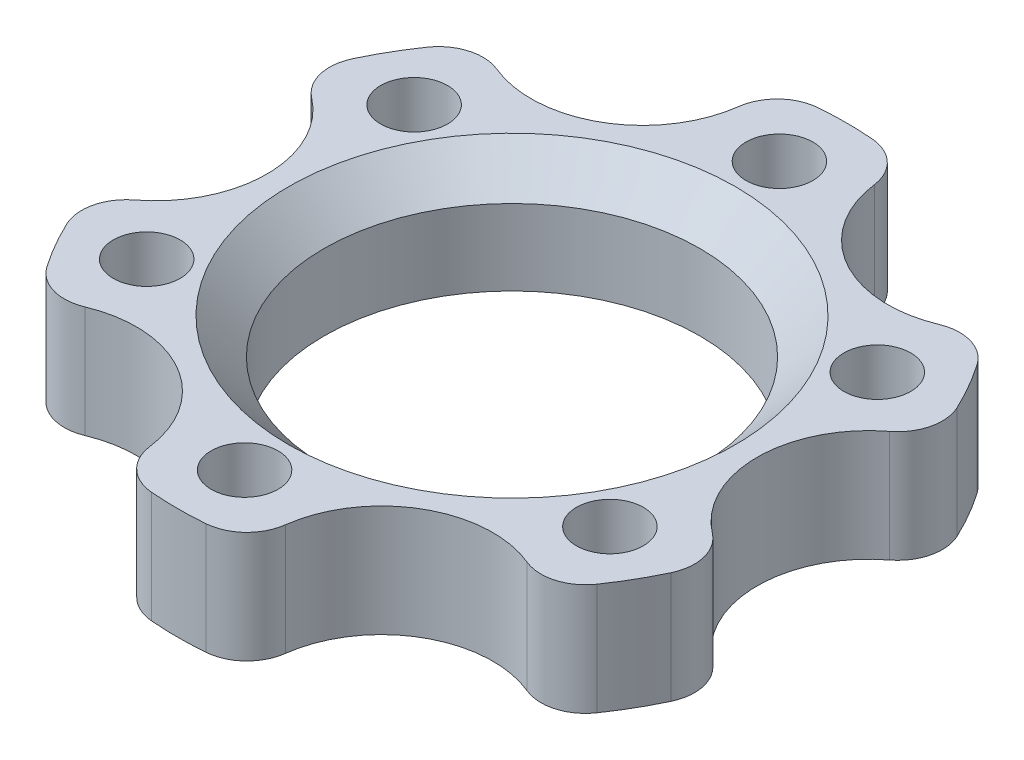
ISO-10303-21;
HEADER;
FILE_DESCRIPTION(('STEP AP214'),'2;1');
FILE_NAME('part.step','',(''),(''),'','','');
FILE_SCHEMA(('AUTOMOTIVE_DESIGN { 1 0 10303 214 1 1 1 1 }'));
ENDSEC;
DATA;
#1=APPLICATION_CONTEXT('core data for automotive mechanical design processes');
#2=APPLICATION_PROTOCOL_DEFINITION('international standard','automotive_design',2000,#1);
#3=PRODUCT_CONTEXT('',#1,'mechanical');
#4=PRODUCT('Part','Part','',(#3));
#5=PRODUCT_RELATED_PRODUCT_CATEGORY('part','',(#4));
#6=PRODUCT_DEFINITION_FORMATION('','',#4);
#7=PRODUCT_DEFINITION_CONTEXT('part definition',#1,'design');
#8=PRODUCT_DEFINITION('design','',#6,#7);
#9=PRODUCT_DEFINITION_SHAPE('','',#8);
#10=(LENGTH_UNIT() NAMED_UNIT(*) SI_UNIT(.MILLI.,.METRE.));
#11=(NAMED_UNIT(*) PLANE_ANGLE_UNIT() SI_UNIT($,.RADIAN.));
#12=(NAMED_UNIT(*) SI_UNIT($,.STERADIAN.) SOLID_ANGLE_UNIT());
#13=UNCERTAINTY_MEASURE_WITH_UNIT(LENGTH_MEASURE(1.E-05),#10,'distance_accuracy_value','');
#14=(GEOMETRIC_REPRESENTATION_CONTEXT(3) GLOBAL_UNCERTAINTY_ASSIGNED_CONTEXT((#13)) GLOBAL_UNIT_ASSIGNED_CONTEXT((#10,
#11,#12)) REPRESENTATION_CONTEXT('',''));
#15=CARTESIAN_POINT('',(0.,0.,0.));
#16=DIRECTION('',(0.,0.,1.));
#17=DIRECTION('',(1.,0.,0.));
#18=AXIS2_PLACEMENT_3D('',#15,#16,#17);
#19=CARTESIAN_POINT('',(0.,0.,0.));
#20=DIRECTION('',(0.,-1.,0.));
#21=DIRECTION('',(0.,0.,-1.));
#22=AXIS2_PLACEMENT_3D('',#19,#20,#21);
#23=CYLINDRICAL_SURFACE('',#22,47.625);
#24=CARTESIAN_POINT('',(0.,-9.525,0.));
#25=DIRECTION('',(0.,-1.,0.));
#26=DIRECTION('',(0.,0.,-1.));
#27=AXIS2_PLACEMENT_3D('',#24,#25,#26);
#28=CIRCLE('',#27,47.625);
#29=CARTESIAN_POINT('',(-39.1695923526614,-9.525,27.0902871879634));
#30=VERTEX_POINT('',#29);
#31=CARTESIAN_POINT('',(-43.0456730769231,-9.525,20.3767184393037));
#32=VERTEX_POINT('',#31);
#33=EDGE_CURVE('E282',#30,#32,#28,.T.);
#34=ORIENTED_EDGE('',*,*,#33,.F.);
#35=DIRECTION('',(0.,-1.,0.));
#36=VECTOR('',#35,1.);
#37=CARTESIAN_POINT('',(-39.1695923526614,0.,27.0902871879634));
#38=LINE('',#37,#36);
#39=CARTESIAN_POINT('',(-39.1695923526614,6.35,27.0902871879634));
#40=VERTEX_POINT('',#39);
#41=EDGE_CURVE('E310',#30,#40,#38,.F.);
#42=ORIENTED_EDGE('',*,*,#41,.T.);
#43=CARTESIAN_POINT('',(0.,6.35,0.));
#44=DIRECTION('',(0.,-1.,0.));
#45=DIRECTION('',(0.,0.,-1.));
#46=AXIS2_PLACEMENT_3D('',#43,#44,#45);
#47=CIRCLE('',#46,47.625);
#48=CARTESIAN_POINT('',(-43.0456730769231,6.35,20.3767184393037));
#49=VERTEX_POINT('',#48);
#50=EDGE_CURVE('E238',#40,#49,#47,.T.);
#51=ORIENTED_EDGE('',*,*,#50,.T.);
#52=DIRECTION('',(0.,-1.,0.));
#53=VECTOR('',#52,1.);
#54=CARTESIAN_POINT('',(-43.0456730769231,0.,20.3767184393037));
#55=LINE('',#54,#53);
#56=EDGE_CURVE('E313',#49,#32,#55,.T.);
#57=ORIENTED_EDGE('',*,*,#56,.T.);
#58=EDGE_LOOP('',(#34,#42,#51,#57));
#59=FACE_BOUND('',#58,.T.);
#60=ADVANCED_FACE('F44',(#59),#23,.T.);
#61=CARTESIAN_POINT('',(-43.0456730769231,6.35,-20.3767184393037));
#62=VERTEX_POINT('',#61);
#63=CARTESIAN_POINT('',(-39.1695923526613,6.35,-27.0902871879634));
#64=VERTEX_POINT('',#63);
#65=EDGE_CURVE('E240',#62,#64,#47,.T.);
#66=ORIENTED_EDGE('',*,*,#65,.T.);
#67=DIRECTION('',(0.,-1.,0.));
#68=VECTOR('',#67,1.);
#69=CARTESIAN_POINT('',(-39.1695923526613,0.,-27.0902871879634));
#70=LINE('',#69,#68);
#71=CARTESIAN_POINT('',(-39.1695923526613,-9.525,-27.0902871879634));
#72=VERTEX_POINT('',#71);
#73=EDGE_CURVE('E370',#64,#72,#70,.T.);
#74=ORIENTED_EDGE('',*,*,#73,.T.);
#75=CARTESIAN_POINT('',(-43.0456730769231,-9.525,-20.3767184393037));
#76=VERTEX_POINT('',#75);
#77=EDGE_CURVE('E276',#76,#72,#28,.T.);
#78=ORIENTED_EDGE('',*,*,#77,.F.);
#79=DIRECTION('',(0.,-1.,0.));
#80=VECTOR('',#79,1.);
#81=CARTESIAN_POINT('',(-43.0456730769231,0.,-20.3767184393037));
#82=LINE('',#81,#80);
#83=EDGE_CURVE('E367',#76,#62,#82,.F.);
#84=ORIENTED_EDGE('',*,*,#83,.T.);
#85=EDGE_LOOP('',(#66,#74,#78,#84));
#86=FACE_BOUND('',#85,.T.);
#87=ADVANCED_FACE('F494',(#86),#23,.T.);
#88=CARTESIAN_POINT('',(3.87608072426172,6.35,47.4670056272671));
#89=VERTEX_POINT('',#88);
#90=CARTESIAN_POINT('',(-3.87608072426172,6.35,47.4670056272671));
#91=VERTEX_POINT('',#90);
#92=EDGE_CURVE('E223',#89,#91,#47,.T.);
#93=ORIENTED_EDGE('',*,*,#92,.T.);
#94=DIRECTION('',(0.,-1.,0.));
#95=VECTOR('',#94,1.);
#96=CARTESIAN_POINT('',(-3.87608072426172,0.,47.4670056272671));
#97=LINE('',#96,#95);
#98=CARTESIAN_POINT('',(-3.87608072426172,-9.525,47.4670056272671));
#99=VERTEX_POINT('',#98);
#100=EDGE_CURVE('E228',#91,#99,#97,.T.);
#101=ORIENTED_EDGE('',*,*,#100,.T.);
#102=CARTESIAN_POINT('',(3.87608072426172,-9.525,47.4670056272671));
#103=VERTEX_POINT('',#102);
#104=EDGE_CURVE('E226',#103,#99,#28,.T.);
#105=ORIENTED_EDGE('',*,*,#104,.F.);
#106=DIRECTION('',(0.,-1.,0.));
#107=VECTOR('',#106,1.);
#108=CARTESIAN_POINT('',(3.87608072426172,0.,47.4670056272671));
#109=LINE('',#108,#107);
#110=EDGE_CURVE('E209',#103,#89,#109,.F.);
#111=ORIENTED_EDGE('',*,*,#110,.T.);
#112=EDGE_LOOP('',(#93,#101,#105,#111));
#113=FACE_BOUND('',#112,.T.);
#114=ADVANCED_FACE('F221',(#113),#23,.T.);
#115=CARTESIAN_POINT('',(43.0456730769231,6.35,20.3767184393037));
#116=VERTEX_POINT('',#115);
#117=CARTESIAN_POINT('',(39.1695923526613,6.35,27.0902871879634));
#118=VERTEX_POINT('',#117);
#119=EDGE_CURVE('E237',#116,#118,#47,.T.);
#120=ORIENTED_EDGE('',*,*,#119,.T.);
#121=DIRECTION('',(0.,-1.,0.));
#122=VECTOR('',#121,1.);
#123=CARTESIAN_POINT('',(39.1695923526613,0.,27.0902871879634));
#124=LINE('',#123,#122);
#125=CARTESIAN_POINT('',(39.1695923526613,-9.525,27.0902871879634));
#126=VERTEX_POINT('',#125);
#127=EDGE_CURVE('E324',#118,#126,#124,.T.);
#128=ORIENTED_EDGE('',*,*,#127,.T.);
#129=CARTESIAN_POINT('',(43.0456730769231,-9.525,20.3767184393037));
#130=VERTEX_POINT('',#129);
#131=EDGE_CURVE('E283',#130,#126,#28,.T.);
#132=ORIENTED_EDGE('',*,*,#131,.F.);
#133=DIRECTION('',(0.,-1.,0.));
#134=VECTOR('',#133,1.);
#135=CARTESIAN_POINT('',(43.0456730769231,0.,20.3767184393037));
#136=LINE('',#135,#134);
#137=EDGE_CURVE('E319',#130,#116,#136,.F.);
#138=ORIENTED_EDGE('',*,*,#137,.T.);
#139=EDGE_LOOP('',(#120,#128,#132,#138));
#140=FACE_BOUND('',#139,.T.);
#141=ADVANCED_FACE('F513',(#140),#23,.T.);
#142=CARTESIAN_POINT('',(39.1695923526614,6.35,-27.0902871879634));
#143=VERTEX_POINT('',#142);
#144=CARTESIAN_POINT('',(43.0456730769231,6.35,-20.3767184393037));
#145=VERTEX_POINT('',#144);
#146=EDGE_CURVE('E244',#143,#145,#47,.T.);
#147=ORIENTED_EDGE('',*,*,#146,.T.);
#148=DIRECTION('',(0.,-1.,0.));
#149=VECTOR('',#148,1.);
#150=CARTESIAN_POINT('',(43.0456730769231,0.,-20.3767184393037));
#151=LINE('',#150,#149);
#152=CARTESIAN_POINT('',(43.0456730769231,-9.525,-20.3767184393037));
#153=VERTEX_POINT('',#152);
#154=EDGE_CURVE('E346',#145,#153,#151,.T.);
#155=ORIENTED_EDGE('',*,*,#154,.T.);
#156=CARTESIAN_POINT('',(39.1695923526614,-9.525,-27.0902871879634));
#157=VERTEX_POINT('',#156);
#158=EDGE_CURVE('E277',#157,#153,#28,.T.);
#159=ORIENTED_EDGE('',*,*,#158,.F.);
#160=DIRECTION('',(0.,-1.,0.));
#161=VECTOR('',#160,1.);
#162=CARTESIAN_POINT('',(39.1695923526614,0.,-27.0902871879634));
#163=LINE('',#162,#161);
#164=EDGE_CURVE('E343',#157,#143,#163,.F.);
#165=ORIENTED_EDGE('',*,*,#164,.T.);
#166=EDGE_LOOP('',(#147,#155,#159,#165));
#167=FACE_BOUND('',#166,.T.);
#168=ADVANCED_FACE('F503',(#167),#23,.T.);
#169=CARTESIAN_POINT('',(0.,1.26999999999998,0.));
#170=DIRECTION('',(0.,1.,0.));
#171=DIRECTION('',(0.,0.,1.));
#172=AXIS2_PLACEMENT_3D('',#169,#170,#171);
#173=CONICAL_SURFACE('',#172,26.7598025612107,0.785398163397454);
#174=CARTESIAN_POINT('',(0.,6.35,0.));
#175=DIRECTION('',(0.,-1.,0.));
#176=DIRECTION('',(0.,0.,-1.));
#177=AXIS2_PLACEMENT_3D('',#174,#175,#176);
#178=CIRCLE('',#177,31.8398025612108);
#179=CARTESIAN_POINT('',(0.,6.35,-31.8398025612108));
#180=VERTEX_POINT('',#179);
#181=EDGE_CURVE('E257',#180,#180,#178,.T.);
#182=ORIENTED_EDGE('',*,*,#181,.F.);
#183=EDGE_LOOP('',(#182));
#184=FACE_BOUND('',#183,.T.);
#185=CARTESIAN_POINT('',(0.,1.26999999999998,0.));
#186=DIRECTION('',(0.,-1.,0.));
#187=DIRECTION('',(0.,0.,-1.));
#188=AXIS2_PLACEMENT_3D('',#185,#186,#187);
#189=CIRCLE('',#188,26.7598025612107);
#190=CARTESIAN_POINT('',(0.,1.26999999999998,-26.7598025612107));
#191=VERTEX_POINT('',#190);
#192=EDGE_CURVE('E292',#191,#191,#189,.T.);
#193=ORIENTED_EDGE('',*,*,#192,.T.);
#194=EDGE_LOOP('',(#193));
#195=FACE_BOUND('',#194,.T.);
#196=ADVANCED_FACE('F512',(#184,#195),#173,.F.);
#197=CARTESIAN_POINT('',(0.,0.,0.));
#198=DIRECTION('',(0.,-1.,0.));
#199=DIRECTION('',(0.,0.,-1.));
#200=AXIS2_PLACEMENT_3D('',#197,#198,#199);
#201=CYLINDRICAL_SURFACE('',#200,26.7598025612107);
#202=CARTESIAN_POINT('',(0.,-9.525,0.));
#203=DIRECTION('',(0.,-1.,0.));
#204=DIRECTION('',(0.,0.,-1.));
#205=AXIS2_PLACEMENT_3D('',#202,#203,#204);
#206=CIRCLE('',#205,26.7598025612107);
#207=CARTESIAN_POINT('',(0.,-9.525,-26.7598025612107));
#208=VERTEX_POINT('',#207);
#209=EDGE_CURVE('E287',#208,#208,#206,.T.);
#210=ORIENTED_EDGE('',*,*,#209,.T.);
#211=EDGE_LOOP('',(#210));
#212=FACE_BOUND('',#211,.T.);
#213=ORIENTED_EDGE('',*,*,#192,.F.);
#214=EDGE_LOOP('',(#213));
#215=FACE_BOUND('',#214,.T.);
#216=ADVANCED_FACE('F509',(#212,#215),#201,.F.);
#217=CARTESIAN_POINT('',(0.,-9.525,0.));
#218=DIRECTION('',(0.,-1.,0.));
#219=DIRECTION('',(0.,0.,-1.));
#220=AXIS2_PLACEMENT_3D('',#217,#218,#219);
#221=PLANE('',#220);
#222=CARTESIAN_POINT('',(-32.9955678841871,-9.525,19.05));
#223=DIRECTION('',(0.,-1.,0.));
#224=DIRECTION('',(0.,0.,-1.));
#225=AXIS2_PLACEMENT_3D('',#222,#223,#224);
#226=CIRCLE('',#225,4.7625);
#227=CARTESIAN_POINT('',(-32.9955678841871,-9.525,14.2875));
#228=VERTEX_POINT('',#227);
#229=EDGE_CURVE('E554',#228,#228,#226,.T.);
#230=ORIENTED_EDGE('',*,*,#229,.F.);
#231=EDGE_LOOP('',(#230));
#232=FACE_BOUND('',#231,.T.);
#233=CARTESIAN_POINT('',(-32.9955678841871,-9.525,-19.05));
#234=DIRECTION('',(0.,-1.,0.));
#235=DIRECTION('',(0.,0.,-1.));
#236=AXIS2_PLACEMENT_3D('',#233,#234,#235);
#237=CIRCLE('',#236,4.7625);
#238=CARTESIAN_POINT('',(-32.9955678841871,-9.525,-23.8125));
#239=VERTEX_POINT('',#238);
#240=EDGE_CURVE('E989',#239,#239,#237,.T.);
#241=ORIENTED_EDGE('',*,*,#240,.F.);
#242=EDGE_LOOP('',(#241));
#243=FACE_BOUND('',#242,.T.);
#244=ORIENTED_EDGE('',*,*,#104,.T.);
#245=CARTESIAN_POINT('',(-3.35926996102682,-9.525,41.1380715436315));
#246=DIRECTION('',(0.,-1.,0.));
#247=DIRECTION('',(0.,0.,-1.));
#248=AXIS2_PLACEMENT_3D('',#245,#246,#247);
#249=CIRCLE('',#248,6.35);
#250=CARTESIAN_POINT('',(-9.65662140073345,-9.525,41.9540769632366));
#251=VERTEX_POINT('',#250);
#252=EDGE_CURVE('E419',#99,#251,#249,.T.);
#253=ORIENTED_EDGE('',*,*,#252,.T.);
#254=CARTESIAN_POINT('',(-25.4,-9.525,43.9940905122495));
#255=DIRECTION('',(0.,-1.,0.));
#256=DIRECTION('',(0.,0.,-1.));
#257=AXIS2_PLACEMENT_3D('',#254,#255,#256);
#258=CIRCLE('',#257,15.875);
#259=CARTESIAN_POINT('',(-31.5049857421237,-9.525,29.3399179293819));
#260=VERTEX_POINT('',#259);
#261=EDGE_CURVE('E383',#260,#251,#258,.T.);
#262=ORIENTED_EDGE('',*,*,#261,.F.);
#263=CARTESIAN_POINT('',(-33.9469800389732,-9.525,23.4782488962349));
#264=DIRECTION('',(0.,-1.,0.));
#265=DIRECTION('',(0.,0.,-1.));
#266=AXIS2_PLACEMENT_3D('',#263,#264,#265);
#267=CIRCLE('',#266,6.35);
#268=EDGE_CURVE('E305',#260,#30,#267,.T.);
#269=ORIENTED_EDGE('',*,*,#268,.T.);
#270=ORIENTED_EDGE('',*,*,#33,.T.);
#271=CARTESIAN_POINT('',(-37.30625,-9.525,17.6598226473965));
#272=DIRECTION('',(0.,-1.,0.));
#273=DIRECTION('',(0.,0.,-1.));
#274=AXIS2_PLACEMENT_3D('',#271,#272,#273);
#275=CIRCLE('',#274,6.35);
#276=CARTESIAN_POINT('',(-41.1616071428571,-9.525,12.6141590338547));
#277=VERTEX_POINT('',#276);
#278=EDGE_CURVE('E302',#32,#277,#275,.T.);
#279=ORIENTED_EDGE('',*,*,#278,.T.);
#280=CARTESIAN_POINT('',(-50.8,-9.525,0.));
#281=DIRECTION('',(0.,-1.,0.));
#282=DIRECTION('',(0.,0.,-1.));
#283=AXIS2_PLACEMENT_3D('',#280,#281,#282);
#284=CIRCLE('',#283,15.875);
#285=CARTESIAN_POINT('',(-41.1616071428571,-9.525,-12.6141590338547));
#286=VERTEX_POINT('',#285);
#287=EDGE_CURVE('E375',#286,#277,#284,.T.);
#288=ORIENTED_EDGE('',*,*,#287,.F.);
#289=CARTESIAN_POINT('',(-37.30625,-9.525,-17.6598226473965));
#290=DIRECTION('',(0.,-1.,0.));
#291=DIRECTION('',(0.,0.,-1.));
#292=AXIS2_PLACEMENT_3D('',#289,#290,#291);
#293=CIRCLE('',#292,6.35);
#294=EDGE_CURVE('E379',#286,#76,#293,.T.);
#295=ORIENTED_EDGE('',*,*,#294,.T.);
#296=ORIENTED_EDGE('',*,*,#77,.T.);
#297=CARTESIAN_POINT('',(-33.9469800389732,-9.525,-23.478248896235));
#298=DIRECTION('',(0.,-1.,0.));
#299=DIRECTION('',(0.,0.,-1.));
#300=AXIS2_PLACEMENT_3D('',#297,#298,#299);
#301=CIRCLE('',#300,6.35);
#302=CARTESIAN_POINT('',(-31.5049857421237,-9.525,-29.339917929382));
#303=VERTEX_POINT('',#302);
#304=EDGE_CURVE('E390',#72,#303,#301,.T.);
#305=ORIENTED_EDGE('',*,*,#304,.T.);
#306=CARTESIAN_POINT('',(-25.4,-9.525,-43.9940905122495));
#307=DIRECTION('',(0.,-1.,0.));
#308=DIRECTION('',(0.,0.,-1.));
#309=AXIS2_PLACEMENT_3D('',#306,#307,#308);
#310=CIRCLE('',#309,15.875);
#311=CARTESIAN_POINT('',(-9.65662140073341,-9.525,-41.9540769632366));
#312=VERTEX_POINT('',#311);
#313=EDGE_CURVE('E976',#312,#303,#310,.T.);
#314=ORIENTED_EDGE('',*,*,#313,.F.);
#315=CARTESIAN_POINT('',(-3.3592699610268,-9.525,-41.1380715436315));
#316=DIRECTION('',(0.,-1.,0.));
#317=DIRECTION('',(0.,0.,-1.));
#318=AXIS2_PLACEMENT_3D('',#315,#316,#317);
#319=CIRCLE('',#318,6.35);
#320=CARTESIAN_POINT('',(-3.87608072426169,-9.525,-47.4670056272671));
#321=VERTEX_POINT('',#320);
#322=EDGE_CURVE('E396',#312,#321,#319,.T.);
#323=ORIENTED_EDGE('',*,*,#322,.T.);
#324=CARTESIAN_POINT('',(3.87608072426175,-9.525,-47.4670056272671));
#325=VERTEX_POINT('',#324);
#326=EDGE_CURVE('E268',#321,#325,#28,.T.);
#327=ORIENTED_EDGE('',*,*,#326,.T.);
#328=CARTESIAN_POINT('',(3.35926996102685,-9.525,-41.1380715436315));
#329=DIRECTION('',(0.,-1.,0.));
#330=DIRECTION('',(0.,0.,-1.));
#331=AXIS2_PLACEMENT_3D('',#328,#329,#330);
#332=CIRCLE('',#331,6.35);
#333=CARTESIAN_POINT('',(9.65662140073347,-9.525,-41.9540769632366));
#334=VERTEX_POINT('',#333);
#335=EDGE_CURVE('E399',#325,#334,#332,.T.);
#336=ORIENTED_EDGE('',*,*,#335,.T.);
#337=CARTESIAN_POINT('',(25.4,-9.525,-43.9940905122495));
#338=DIRECTION('',(0.,-1.,0.));
#339=DIRECTION('',(0.,0.,-1.));
#340=AXIS2_PLACEMENT_3D('',#337,#338,#339);
#341=CIRCLE('',#340,15.875);
#342=CARTESIAN_POINT('',(31.5049857421237,-9.525,-29.3399179293819));
#343=VERTEX_POINT('',#342);
#344=EDGE_CURVE('E546',#343,#334,#341,.T.);
#345=ORIENTED_EDGE('',*,*,#344,.F.);
#346=CARTESIAN_POINT('',(33.9469800389732,-9.525,-23.4782488962349));
#347=DIRECTION('',(0.,-1.,0.));
#348=DIRECTION('',(0.,0.,-1.));
#349=AXIS2_PLACEMENT_3D('',#346,#347,#348);
#350=CIRCLE('',#349,6.35);
#351=EDGE_CURVE('E402',#343,#157,#350,.T.);
#352=ORIENTED_EDGE('',*,*,#351,.T.);
#353=ORIENTED_EDGE('',*,*,#158,.T.);
#354=CARTESIAN_POINT('',(37.30625,-9.525,-17.6598226473965));
#355=DIRECTION('',(0.,-1.,0.));
#356=DIRECTION('',(0.,0.,-1.));
#357=AXIS2_PLACEMENT_3D('',#354,#355,#356);
#358=CIRCLE('',#357,6.35);
#359=CARTESIAN_POINT('',(41.1616071428571,-9.525,-12.6141590338547));
#360=VERTEX_POINT('',#359);
#361=EDGE_CURVE('E405',#153,#360,#358,.T.);
#362=ORIENTED_EDGE('',*,*,#361,.T.);
#363=CARTESIAN_POINT('',(50.8,-9.525,0.));
#364=DIRECTION('',(0.,-1.,0.));
#365=DIRECTION('',(0.,0.,-1.));
#366=AXIS2_PLACEMENT_3D('',#363,#364,#365);
#367=CIRCLE('',#366,15.875);
#368=CARTESIAN_POINT('',(41.1616071428571,-9.525,12.6141590338547));
#369=VERTEX_POINT('',#368);
#370=EDGE_CURVE('E538',#369,#360,#367,.T.);
#371=ORIENTED_EDGE('',*,*,#370,.F.);
#372=CARTESIAN_POINT('',(37.30625,-9.525,17.6598226473966));
#373=DIRECTION('',(0.,-1.,0.));
#374=DIRECTION('',(0.,0.,-1.));
#375=AXIS2_PLACEMENT_3D('',#372,#373,#374);
#376=CIRCLE('',#375,6.35);
#377=EDGE_CURVE('E408',#369,#130,#376,.T.);
#378=ORIENTED_EDGE('',*,*,#377,.T.);
#379=ORIENTED_EDGE('',*,*,#131,.T.);
#380=CARTESIAN_POINT('',(33.9469800389732,-9.525,23.4782488962349));
#381=DIRECTION('',(0.,-1.,0.));
#382=DIRECTION('',(0.,0.,-1.));
#383=AXIS2_PLACEMENT_3D('',#380,#381,#382);
#384=CIRCLE('',#383,6.35);
#385=CARTESIAN_POINT('',(31.5049857421237,-9.525,29.339917929382));
#386=VERTEX_POINT('',#385);
#387=EDGE_CURVE('E414',#126,#386,#384,.T.);
#388=ORIENTED_EDGE('',*,*,#387,.T.);
#389=CARTESIAN_POINT('',(25.4,-9.525,43.9940905122495));
#390=DIRECTION('',(0.,-1.,0.));
#391=DIRECTION('',(0.,0.,-1.));
#392=AXIS2_PLACEMENT_3D('',#389,#390,#391);
#393=CIRCLE('',#392,15.875);
#394=CARTESIAN_POINT('',(9.65662140073344,-9.525,41.9540769632366));
#395=VERTEX_POINT('',#394);
#396=EDGE_CURVE('E533',#395,#386,#393,.T.);
#397=ORIENTED_EDGE('',*,*,#396,.F.);
#398=CARTESIAN_POINT('',(3.35926996102682,-9.525,41.1380715436315));
#399=DIRECTION('',(0.,-1.,0.));
#400=DIRECTION('',(0.,0.,-1.));
#401=AXIS2_PLACEMENT_3D('',#398,#399,#400);
#402=CIRCLE('',#401,6.35);
#403=EDGE_CURVE('E411',#395,#103,#402,.T.);
#404=ORIENTED_EDGE('',*,*,#403,.T.);
#405=EDGE_LOOP('',(#244,#253,#262,#269,#270,#279,#288,#295,#296,#305,#314,#323,#327,#336,#345,
#352,#353,#362,#371,#378,#379,#388,#397,#404));
#406=FACE_BOUND('',#405,.T.);
#407=CARTESIAN_POINT('',(32.9955678841871,-9.525,-19.05));
#408=DIRECTION('',(0.,-1.,0.));
#409=DIRECTION('',(0.,0.,-1.));
#410=AXIS2_PLACEMENT_3D('',#407,#408,#409);
#411=CIRCLE('',#410,4.7625);
#412=CARTESIAN_POINT('',(32.9955678841871,-9.525,-23.8125));
#413=VERTEX_POINT('',#412);
#414=EDGE_CURVE('E537',#413,#413,#411,.T.);
#415=ORIENTED_EDGE('',*,*,#414,.F.);
#416=EDGE_LOOP('',(#415));
#417=FACE_BOUND('',#416,.T.);
#418=CARTESIAN_POINT('',(32.9955678841871,-9.525,19.05));
#419=DIRECTION('',(0.,-1.,0.));
#420=DIRECTION('',(0.,0.,-1.));
#421=AXIS2_PLACEMENT_3D('',#418,#419,#420);
#422=CIRCLE('',#421,4.7625);
#423=CARTESIAN_POINT('',(32.9955678841871,-9.525,14.2875));
#424=VERTEX_POINT('',#423);
#425=EDGE_CURVE('E543',#424,#424,#422,.T.);
#426=ORIENTED_EDGE('',*,*,#425,.F.);
#427=EDGE_LOOP('',(#426));
#428=FACE_BOUND('',#427,.T.);
#429=CARTESIAN_POINT('',(0.,-9.525,38.1));
#430=DIRECTION('',(0.,-1.,0.));
#431=DIRECTION('',(0.,0.,-1.));
#432=AXIS2_PLACEMENT_3D('',#429,#430,#431);
#433=CIRCLE('',#432,4.7625);
#434=CARTESIAN_POINT('',(0.,-9.525,33.3375));
#435=VERTEX_POINT('',#434);
#436=EDGE_CURVE('E550',#435,#435,#433,.T.);
#437=ORIENTED_EDGE('',*,*,#436,.F.);
#438=EDGE_LOOP('',(#437));
#439=FACE_BOUND('',#438,.T.);
#440=CARTESIAN_POINT('',(0.,-9.525,-38.1));
#441=DIRECTION('',(0.,-1.,0.));
#442=DIRECTION('',(0.,0.,-1.));
#443=AXIS2_PLACEMENT_3D('',#440,#441,#442);
#444=CIRCLE('',#443,4.7625);
#445=CARTESIAN_POINT('',(0.,-9.525,-42.8625));
#446=VERTEX_POINT('',#445);
#447=EDGE_CURVE('E382',#446,#446,#444,.T.);
#448=ORIENTED_EDGE('',*,*,#447,.F.);
#449=EDGE_LOOP('',(#448));
#450=FACE_BOUND('',#449,.T.);
#451=ORIENTED_EDGE('',*,*,#209,.F.);
#452=EDGE_LOOP('',(#451));
#453=FACE_BOUND('',#452,.T.);
#454=ADVANCED_FACE('F299',(#232,#243,#406,#417,#428,#439,#450,#453),#221,.T.);
#455=CARTESIAN_POINT('',(-3.87608072426169,6.35,-47.4670056272671));
#456=VERTEX_POINT('',#455);
#457=CARTESIAN_POINT('',(3.87608072426175,6.35,-47.4670056272671));
#458=VERTEX_POINT('',#457);
#459=EDGE_CURVE('E250',#456,#458,#47,.T.);
#460=ORIENTED_EDGE('',*,*,#459,.T.);
#461=DIRECTION('',(0.,-1.,0.));
#462=VECTOR('',#461,1.);
#463=CARTESIAN_POINT('',(3.87608072426175,0.,-47.4670056272671));
#464=LINE('',#463,#462);
#465=EDGE_CURVE('E358',#458,#325,#464,.T.);
#466=ORIENTED_EDGE('',*,*,#465,.T.);
#467=ORIENTED_EDGE('',*,*,#326,.F.);
#468=DIRECTION('',(0.,-1.,0.));
#469=VECTOR('',#468,1.);
#470=CARTESIAN_POINT('',(-3.87608072426169,0.,-47.4670056272671));
#471=LINE('',#470,#469);
#472=EDGE_CURVE('E355',#321,#456,#471,.F.);
#473=ORIENTED_EDGE('',*,*,#472,.T.);
#474=EDGE_LOOP('',(#460,#466,#467,#473));
#475=FACE_BOUND('',#474,.T.);
#476=ADVANCED_FACE('F496',(#475),#23,.T.);
#477=CARTESIAN_POINT('',(0.,6.35,0.));
#478=DIRECTION('',(0.,-1.,0.));
#479=DIRECTION('',(0.,0.,-1.));
#480=AXIS2_PLACEMENT_3D('',#477,#478,#479);
#481=PLANE('',#480);
#482=CARTESIAN_POINT('',(-32.9955678841871,6.35,19.05));
#483=DIRECTION('',(0.,-1.,0.));
#484=DIRECTION('',(0.,0.,-1.));
#485=AXIS2_PLACEMENT_3D('',#482,#483,#484);
#486=CIRCLE('',#485,4.7625);
#487=CARTESIAN_POINT('',(-32.9955678841871,6.35,14.2875));
#488=VERTEX_POINT('',#487);
#489=EDGE_CURVE('E265',#488,#488,#486,.T.);
#490=ORIENTED_EDGE('',*,*,#489,.T.);
#491=EDGE_LOOP('',(#490));
#492=FACE_BOUND('',#491,.T.);
#493=CARTESIAN_POINT('',(-32.9955678841871,6.35,-19.05));
#494=DIRECTION('',(0.,-1.,0.));
#495=DIRECTION('',(0.,0.,-1.));
#496=AXIS2_PLACEMENT_3D('',#493,#494,#495);
#497=CIRCLE('',#496,4.7625);
#498=CARTESIAN_POINT('',(-32.9955678841871,6.35,-23.8125));
#499=VERTEX_POINT('',#498);
#500=EDGE_CURVE('E466',#499,#499,#497,.T.);
#501=ORIENTED_EDGE('',*,*,#500,.T.);
#502=EDGE_LOOP('',(#501));
#503=FACE_BOUND('',#502,.T.);
#504=CARTESIAN_POINT('',(32.9955678841871,6.35,-19.05));
#505=DIRECTION('',(0.,-1.,0.));
#506=DIRECTION('',(0.,0.,-1.));
#507=AXIS2_PLACEMENT_3D('',#504,#505,#506);
#508=CIRCLE('',#507,4.7625);
#509=CARTESIAN_POINT('',(32.9955678841871,6.35,-23.8125));
#510=VERTEX_POINT('',#509);
#511=EDGE_CURVE('E470',#510,#510,#508,.T.);
#512=ORIENTED_EDGE('',*,*,#511,.T.);
#513=EDGE_LOOP('',(#512));
#514=FACE_BOUND('',#513,.T.);
#515=CARTESIAN_POINT('',(32.9955678841871,6.35,19.05));
#516=DIRECTION('',(0.,-1.,0.));
#517=DIRECTION('',(0.,0.,-1.));
#518=AXIS2_PLACEMENT_3D('',#515,#516,#517);
#519=CIRCLE('',#518,4.7625);
#520=CARTESIAN_POINT('',(32.9955678841871,6.35,14.2875));
#521=VERTEX_POINT('',#520);
#522=EDGE_CURVE('E571',#521,#521,#519,.T.);
#523=ORIENTED_EDGE('',*,*,#522,.T.);
#524=EDGE_LOOP('',(#523));
#525=FACE_BOUND('',#524,.T.);
#526=CARTESIAN_POINT('',(0.,6.35,38.1));
#527=DIRECTION('',(0.,-1.,0.));
#528=DIRECTION('',(0.,0.,-1.));
#529=AXIS2_PLACEMENT_3D('',#526,#527,#528);
#530=CIRCLE('',#529,4.7625);
#531=CARTESIAN_POINT('',(0.,6.35,33.3375));
#532=VERTEX_POINT('',#531);
#533=EDGE_CURVE('E565',#532,#532,#530,.T.);
#534=ORIENTED_EDGE('',*,*,#533,.T.);
#535=EDGE_LOOP('',(#534));
#536=FACE_BOUND('',#535,.T.);
#537=CARTESIAN_POINT('',(0.,6.35,-38.1));
#538=DIRECTION('',(0.,-1.,0.));
#539=DIRECTION('',(0.,0.,-1.));
#540=AXIS2_PLACEMENT_3D('',#537,#538,#539);
#541=CIRCLE('',#540,4.7625);
#542=CARTESIAN_POINT('',(0.,6.35,-42.8625));
#543=VERTEX_POINT('',#542);
#544=EDGE_CURVE('E560',#543,#543,#541,.T.);
#545=ORIENTED_EDGE('',*,*,#544,.T.);
#546=EDGE_LOOP('',(#545));
#547=FACE_BOUND('',#546,.T.);
#548=CARTESIAN_POINT('',(-25.4,6.35,43.9940905122495));
#549=DIRECTION('',(0.,-1.,0.));
#550=DIRECTION('',(0.,0.,-1.));
#551=AXIS2_PLACEMENT_3D('',#548,#549,#550);
#552=CIRCLE('',#551,15.875);
#553=CARTESIAN_POINT('',(-31.5049857421237,6.35,29.3399179293819));
#554=VERTEX_POINT('',#553);
#555=CARTESIAN_POINT('',(-9.65662140073345,6.35,41.9540769632366));
#556=VERTEX_POINT('',#555);
#557=EDGE_CURVE('E229',#554,#556,#552,.T.);
#558=ORIENTED_EDGE('',*,*,#557,.T.);
#559=CARTESIAN_POINT('',(-3.35926996102682,6.35,41.1380715436315));
#560=DIRECTION('',(0.,-1.,0.));
#561=DIRECTION('',(0.,0.,-1.));
#562=AXIS2_PLACEMENT_3D('',#559,#560,#561);
#563=CIRCLE('',#562,6.35);
#564=EDGE_CURVE('E235',#556,#91,#563,.F.);
#565=ORIENTED_EDGE('',*,*,#564,.T.);
#566=ORIENTED_EDGE('',*,*,#92,.F.);
#567=CARTESIAN_POINT('',(3.35926996102682,6.35,41.1380715436315));
#568=DIRECTION('',(0.,-1.,0.));
#569=DIRECTION('',(0.,0.,-1.));
#570=AXIS2_PLACEMENT_3D('',#567,#568,#569);
#571=CIRCLE('',#570,6.35);
#572=CARTESIAN_POINT('',(9.65662140073344,6.35,41.9540769632366));
#573=VERTEX_POINT('',#572);
#574=EDGE_CURVE('E205',#89,#573,#571,.F.);
#575=ORIENTED_EDGE('',*,*,#574,.T.);
#576=CARTESIAN_POINT('',(25.4,6.35,43.9940905122495));
#577=DIRECTION('',(0.,-1.,0.));
#578=DIRECTION('',(0.,0.,-1.));
#579=AXIS2_PLACEMENT_3D('',#576,#577,#578);
#580=CIRCLE('',#579,15.875);
#581=CARTESIAN_POINT('',(31.5049857421237,6.35,29.339917929382));
#582=VERTEX_POINT('',#581);
#583=EDGE_CURVE('E462',#573,#582,#580,.T.);
#584=ORIENTED_EDGE('',*,*,#583,.T.);
#585=CARTESIAN_POINT('',(33.9469800389732,6.35,23.4782488962349));
#586=DIRECTION('',(0.,-1.,0.));
#587=DIRECTION('',(0.,0.,-1.));
#588=AXIS2_PLACEMENT_3D('',#585,#586,#587);
#589=CIRCLE('',#588,6.35);
#590=EDGE_CURVE('E215',#582,#118,#589,.F.);
#591=ORIENTED_EDGE('',*,*,#590,.T.);
#592=ORIENTED_EDGE('',*,*,#119,.F.);
#593=CARTESIAN_POINT('',(37.30625,6.35,17.6598226473966));
#594=DIRECTION('',(0.,-1.,0.));
#595=DIRECTION('',(0.,0.,-1.));
#596=AXIS2_PLACEMENT_3D('',#593,#594,#595);
#597=CIRCLE('',#596,6.35);
#598=CARTESIAN_POINT('',(41.1616071428571,6.35,12.6141590338547));
#599=VERTEX_POINT('',#598);
#600=EDGE_CURVE('E216',#116,#599,#597,.F.);
#601=ORIENTED_EDGE('',*,*,#600,.T.);
#602=CARTESIAN_POINT('',(50.8,6.35,0.));
#603=DIRECTION('',(0.,-1.,0.));
#604=DIRECTION('',(0.,0.,-1.));
#605=AXIS2_PLACEMENT_3D('',#602,#603,#604);
#606=CIRCLE('',#605,15.875);
#607=CARTESIAN_POINT('',(41.1616071428571,6.35,-12.6141590338547));
#608=VERTEX_POINT('',#607);
#609=EDGE_CURVE('E583',#599,#608,#606,.T.);
#610=ORIENTED_EDGE('',*,*,#609,.T.);
#611=CARTESIAN_POINT('',(37.30625,6.35,-17.6598226473965));
#612=DIRECTION('',(0.,-1.,0.));
#613=DIRECTION('',(0.,0.,-1.));
#614=AXIS2_PLACEMENT_3D('',#611,#612,#613);
#615=CIRCLE('',#614,6.35);
#616=EDGE_CURVE('E445',#608,#145,#615,.F.);
#617=ORIENTED_EDGE('',*,*,#616,.T.);
#618=ORIENTED_EDGE('',*,*,#146,.F.);
#619=CARTESIAN_POINT('',(33.9469800389732,6.35,-23.4782488962349));
#620=DIRECTION('',(0.,-1.,0.));
#621=DIRECTION('',(0.,0.,-1.));
#622=AXIS2_PLACEMENT_3D('',#619,#620,#621);
#623=CIRCLE('',#622,6.35);
#624=CARTESIAN_POINT('',(31.5049857421237,6.35,-29.3399179293819));
#625=VERTEX_POINT('',#624);
#626=EDGE_CURVE('E442',#143,#625,#623,.F.);
#627=ORIENTED_EDGE('',*,*,#626,.T.);
#628=CARTESIAN_POINT('',(25.4,6.35,-43.9940905122495));
#629=DIRECTION('',(0.,-1.,0.));
#630=DIRECTION('',(0.,0.,-1.));
#631=AXIS2_PLACEMENT_3D('',#628,#629,#630);
#632=CIRCLE('',#631,15.875);
#633=CARTESIAN_POINT('',(9.65662140073347,6.35,-41.9540769632366));
#634=VERTEX_POINT('',#633);
#635=EDGE_CURVE('E579',#625,#634,#632,.T.);
#636=ORIENTED_EDGE('',*,*,#635,.T.);
#637=CARTESIAN_POINT('',(3.35926996102685,6.35,-41.1380715436315));
#638=DIRECTION('',(0.,-1.,0.));
#639=DIRECTION('',(0.,0.,-1.));
#640=AXIS2_PLACEMENT_3D('',#637,#638,#639);
#641=CIRCLE('',#640,6.35);
#642=EDGE_CURVE('E439',#634,#458,#641,.F.);
#643=ORIENTED_EDGE('',*,*,#642,.T.);
#644=ORIENTED_EDGE('',*,*,#459,.F.);
#645=CARTESIAN_POINT('',(-3.3592699610268,6.35,-41.1380715436315));
#646=DIRECTION('',(0.,-1.,0.));
#647=DIRECTION('',(0.,0.,-1.));
#648=AXIS2_PLACEMENT_3D('',#645,#646,#647);
#649=CIRCLE('',#648,6.35);
#650=CARTESIAN_POINT('',(-9.65662140073341,6.35,-41.9540769632366));
#651=VERTEX_POINT('',#650);
#652=EDGE_CURVE('E436',#456,#651,#649,.F.);
#653=ORIENTED_EDGE('',*,*,#652,.T.);
#654=CARTESIAN_POINT('',(-25.4,6.35,-43.9940905122495));
#655=DIRECTION('',(0.,-1.,0.));
#656=DIRECTION('',(0.,0.,-1.));
#657=AXIS2_PLACEMENT_3D('',#654,#655,#656);
#658=CIRCLE('',#657,15.875);
#659=CARTESIAN_POINT('',(-31.5049857421237,6.35,-29.339917929382));
#660=VERTEX_POINT('',#659);
#661=EDGE_CURVE('E575',#651,#660,#658,.T.);
#662=ORIENTED_EDGE('',*,*,#661,.T.);
#663=CARTESIAN_POINT('',(-33.9469800389732,6.35,-23.478248896235));
#664=DIRECTION('',(0.,-1.,0.));
#665=DIRECTION('',(0.,0.,-1.));
#666=AXIS2_PLACEMENT_3D('',#663,#664,#665);
#667=CIRCLE('',#666,6.35);
#668=EDGE_CURVE('E433',#660,#64,#667,.F.);
#669=ORIENTED_EDGE('',*,*,#668,.T.);
#670=ORIENTED_EDGE('',*,*,#65,.F.);
#671=CARTESIAN_POINT('',(-37.30625,6.35,-17.6598226473965));
#672=DIRECTION('',(0.,-1.,0.));
#673=DIRECTION('',(0.,0.,-1.));
#674=AXIS2_PLACEMENT_3D('',#671,#672,#673);
#675=CIRCLE('',#674,6.35);
#676=CARTESIAN_POINT('',(-41.1616071428571,6.35,-12.6141590338547));
#677=VERTEX_POINT('',#676);
#678=EDGE_CURVE('E65',#62,#677,#675,.F.);
#679=ORIENTED_EDGE('',*,*,#678,.T.);
#680=CARTESIAN_POINT('',(-50.8,6.35,0.));
#681=DIRECTION('',(0.,-1.,0.));
#682=DIRECTION('',(0.,0.,-1.));
#683=AXIS2_PLACEMENT_3D('',#680,#681,#682);
#684=CIRCLE('',#683,15.875);
#685=CARTESIAN_POINT('',(-41.1616071428571,6.35,12.6141590338547));
#686=VERTEX_POINT('',#685);
#687=EDGE_CURVE('E376',#677,#686,#684,.T.);
#688=ORIENTED_EDGE('',*,*,#687,.T.);
#689=CARTESIAN_POINT('',(-37.30625,6.35,17.6598226473965));
#690=DIRECTION('',(0.,-1.,0.));
#691=DIRECTION('',(0.,0.,-1.));
#692=AXIS2_PLACEMENT_3D('',#689,#690,#691);
#693=CIRCLE('',#692,6.35);
#694=EDGE_CURVE('E430',#686,#49,#693,.F.);
#695=ORIENTED_EDGE('',*,*,#694,.T.);
#696=ORIENTED_EDGE('',*,*,#50,.F.);
#697=CARTESIAN_POINT('',(-33.9469800389732,6.35,23.4782488962349));
#698=DIRECTION('',(0.,-1.,0.));
#699=DIRECTION('',(0.,0.,-1.));
#700=AXIS2_PLACEMENT_3D('',#697,#698,#699);
#701=CIRCLE('',#700,6.35);
#702=EDGE_CURVE('E317',#40,#554,#701,.F.);
#703=ORIENTED_EDGE('',*,*,#702,.T.);
#704=EDGE_LOOP('',(#558,#565,#566,#575,#584,#591,#592,#601,#610,#617,#618,#627,#636,#643,#644,
#653,#662,#669,#670,#679,#688,#695,#696,#703));
#705=FACE_BOUND('',#704,.T.);
#706=ORIENTED_EDGE('',*,*,#181,.T.);
#707=EDGE_LOOP('',(#706));
#708=FACE_BOUND('',#707,.T.);
#709=ADVANCED_FACE('F232',(#492,#503,#514,#525,#536,#547,#705,#708),#481,.F.);
#710=CARTESIAN_POINT('',(0.,6.350012,-38.1));
#711=DIRECTION('',(0.,-1.,0.));
#712=DIRECTION('',(0.,0.,-1.));
#713=AXIS2_PLACEMENT_3D('',#710,#711,#712);
#714=CYLINDRICAL_SURFACE('',#713,4.7625);
#715=ORIENTED_EDGE('',*,*,#447,.T.);
#716=EDGE_LOOP('',(#715));
#717=FACE_BOUND('',#716,.T.);
#718=ORIENTED_EDGE('',*,*,#544,.F.);
#719=EDGE_LOOP('',(#718));
#720=FACE_BOUND('',#719,.T.);
#721=ADVANCED_FACE('F508',(#717,#720),#714,.F.);
#722=CARTESIAN_POINT('',(-25.4,6.350012,-43.9940905122495));
#723=DIRECTION('',(0.,-1.,0.));
#724=DIRECTION('',(0.,0.,-1.));
#725=AXIS2_PLACEMENT_3D('',#722,#723,#724);
#726=CYLINDRICAL_SURFACE('',#725,15.875);
#727=ORIENTED_EDGE('',*,*,#661,.F.);
#728=DIRECTION('',(0.,-1.,0.));
#729=VECTOR('',#728,1.);
#730=CARTESIAN_POINT('',(-9.65662140073342,6.350012,-41.9540769632366));
#731=LINE('',#730,#729);
#732=EDGE_CURVE('E364',#651,#312,#731,.T.);
#733=ORIENTED_EDGE('',*,*,#732,.T.);
#734=ORIENTED_EDGE('',*,*,#313,.T.);
#735=DIRECTION('',(0.,-1.,0.));
#736=VECTOR('',#735,1.);
#737=CARTESIAN_POINT('',(-31.5049857421237,6.350012,-29.339917929382));
#738=LINE('',#737,#736);
#739=EDGE_CURVE('E361',#303,#660,#738,.F.);
#740=ORIENTED_EDGE('',*,*,#739,.T.);
#741=EDGE_LOOP('',(#727,#733,#734,#740));
#742=FACE_BOUND('',#741,.T.);
#743=ADVANCED_FACE('F773',(#742),#726,.F.);
#744=CARTESIAN_POINT('',(25.4,6.350012,-43.9940905122495));
#745=DIRECTION('',(0.,-1.,0.));
#746=DIRECTION('',(0.,0.,-1.));
#747=AXIS2_PLACEMENT_3D('',#744,#745,#746);
#748=CYLINDRICAL_SURFACE('',#747,15.875);
#749=ORIENTED_EDGE('',*,*,#635,.F.);
#750=DIRECTION('',(0.,-1.,0.));
#751=VECTOR('',#750,1.);
#752=CARTESIAN_POINT('',(31.5049857421237,6.350012,-29.3399179293819));
#753=LINE('',#752,#751);
#754=EDGE_CURVE('E352',#625,#343,#753,.T.);
#755=ORIENTED_EDGE('',*,*,#754,.T.);
#756=ORIENTED_EDGE('',*,*,#344,.T.);
#757=DIRECTION('',(0.,-1.,0.));
#758=VECTOR('',#757,1.);
#759=CARTESIAN_POINT('',(9.65662140073347,6.350012,-41.9540769632366));
#760=LINE('',#759,#758);
#761=EDGE_CURVE('E349',#334,#634,#760,.F.);
#762=ORIENTED_EDGE('',*,*,#761,.T.);
#763=EDGE_LOOP('',(#749,#755,#756,#762));
#764=FACE_BOUND('',#763,.T.);
#765=ADVANCED_FACE('F760',(#764),#748,.F.);
#766=CARTESIAN_POINT('',(50.8,6.350012,0.));
#767=DIRECTION('',(0.,-1.,0.));
#768=DIRECTION('',(0.,0.,-1.));
#769=AXIS2_PLACEMENT_3D('',#766,#767,#768);
#770=CYLINDRICAL_SURFACE('',#769,15.875);
#771=ORIENTED_EDGE('',*,*,#609,.F.);
#772=DIRECTION('',(0.,-1.,0.));
#773=VECTOR('',#772,1.);
#774=CARTESIAN_POINT('',(41.1616071428571,6.350012,12.6141590338547));
#775=LINE('',#774,#773);
#776=EDGE_CURVE('E340',#599,#369,#775,.T.);
#777=ORIENTED_EDGE('',*,*,#776,.T.);
#778=ORIENTED_EDGE('',*,*,#370,.T.);
#779=DIRECTION('',(0.,-1.,0.));
#780=VECTOR('',#779,1.);
#781=CARTESIAN_POINT('',(41.1616071428571,6.350012,-12.6141590338547));
#782=LINE('',#781,#780);
#783=EDGE_CURVE('E337',#360,#608,#782,.F.);
#784=ORIENTED_EDGE('',*,*,#783,.T.);
#785=EDGE_LOOP('',(#771,#777,#778,#784));
#786=FACE_BOUND('',#785,.T.);
#787=ADVANCED_FACE('F754',(#786),#770,.F.);
#788=CARTESIAN_POINT('',(0.,6.350012,38.1));
#789=DIRECTION('',(0.,-1.,0.));
#790=DIRECTION('',(0.,0.,-1.));
#791=AXIS2_PLACEMENT_3D('',#788,#789,#790);
#792=CYLINDRICAL_SURFACE('',#791,4.7625);
#793=ORIENTED_EDGE('',*,*,#436,.T.);
#794=EDGE_LOOP('',(#793));
#795=FACE_BOUND('',#794,.T.);
#796=ORIENTED_EDGE('',*,*,#533,.F.);
#797=EDGE_LOOP('',(#796));
#798=FACE_BOUND('',#797,.T.);
#799=ADVANCED_FACE('F759',(#795,#798),#792,.F.);
#800=CARTESIAN_POINT('',(32.9955678841871,6.350012,19.05));
#801=DIRECTION('',(0.,-1.,0.));
#802=DIRECTION('',(0.,0.,-1.));
#803=AXIS2_PLACEMENT_3D('',#800,#801,#802);
#804=CYLINDRICAL_SURFACE('',#803,4.7625);
#805=ORIENTED_EDGE('',*,*,#425,.T.);
#806=EDGE_LOOP('',(#805));
#807=FACE_BOUND('',#806,.T.);
#808=ORIENTED_EDGE('',*,*,#522,.F.);
#809=EDGE_LOOP('',(#808));
#810=FACE_BOUND('',#809,.T.);
#811=ADVANCED_FACE('F855',(#807,#810),#804,.F.);
#812=CARTESIAN_POINT('',(32.9955678841871,6.350012,-19.05));
#813=DIRECTION('',(0.,-1.,0.));
#814=DIRECTION('',(0.,0.,-1.));
#815=AXIS2_PLACEMENT_3D('',#812,#813,#814);
#816=CYLINDRICAL_SURFACE('',#815,4.7625);
#817=ORIENTED_EDGE('',*,*,#414,.T.);
#818=EDGE_LOOP('',(#817));
#819=FACE_BOUND('',#818,.T.);
#820=ORIENTED_EDGE('',*,*,#511,.F.);
#821=EDGE_LOOP('',(#820));
#822=FACE_BOUND('',#821,.T.);
#823=ADVANCED_FACE('F746',(#819,#822),#816,.F.);
#824=CARTESIAN_POINT('',(25.4,6.350012,43.9940905122495));
#825=DIRECTION('',(0.,-1.,0.));
#826=DIRECTION('',(0.,0.,-1.));
#827=AXIS2_PLACEMENT_3D('',#824,#825,#826);
#828=CYLINDRICAL_SURFACE('',#827,15.875);
#829=ORIENTED_EDGE('',*,*,#396,.T.);
#830=DIRECTION('',(0.,-1.,0.));
#831=VECTOR('',#830,1.);
#832=CARTESIAN_POINT('',(31.5049857421237,6.350012,29.339917929382));
#833=LINE('',#832,#831);
#834=EDGE_CURVE('E334',#386,#582,#833,.F.);
#835=ORIENTED_EDGE('',*,*,#834,.T.);
#836=ORIENTED_EDGE('',*,*,#583,.F.);
#837=DIRECTION('',(0.,-1.,0.));
#838=VECTOR('',#837,1.);
#839=CARTESIAN_POINT('',(9.65662140073344,6.350012,41.9540769632366));
#840=LINE('',#839,#838);
#841=EDGE_CURVE('E210',#573,#395,#840,.T.);
#842=ORIENTED_EDGE('',*,*,#841,.T.);
#843=EDGE_LOOP('',(#829,#835,#836,#842));
#844=FACE_BOUND('',#843,.T.);
#845=ADVANCED_FACE('F535',(#844),#828,.F.);
#846=CARTESIAN_POINT('',(-50.8,6.350012,0.));
#847=DIRECTION('',(0.,-1.,0.));
#848=DIRECTION('',(0.,0.,-1.));
#849=AXIS2_PLACEMENT_3D('',#846,#847,#848);
#850=CYLINDRICAL_SURFACE('',#849,15.875);
#851=ORIENTED_EDGE('',*,*,#287,.T.);
#852=DIRECTION('',(0.,-1.,0.));
#853=VECTOR('',#852,1.);
#854=CARTESIAN_POINT('',(-41.1616071428571,6.350012,12.6141590338547));
#855=LINE('',#854,#853);
#856=EDGE_CURVE('E11',#277,#686,#855,.F.);
#857=ORIENTED_EDGE('',*,*,#856,.T.);
#858=ORIENTED_EDGE('',*,*,#687,.F.);
#859=DIRECTION('',(0.,-1.,0.));
#860=VECTOR('',#859,1.);
#861=CARTESIAN_POINT('',(-41.1616071428571,6.350012,-12.6141590338547));
#862=LINE('',#861,#860);
#863=EDGE_CURVE('E53',#677,#286,#862,.T.);
#864=ORIENTED_EDGE('',*,*,#863,.T.);
#865=EDGE_LOOP('',(#851,#857,#858,#864));
#866=FACE_BOUND('',#865,.T.);
#867=ADVANCED_FACE('F374',(#866),#850,.F.);
#868=CARTESIAN_POINT('',(-25.4,6.350012,43.9940905122495));
#869=DIRECTION('',(0.,-1.,0.));
#870=DIRECTION('',(0.,0.,-1.));
#871=AXIS2_PLACEMENT_3D('',#868,#869,#870);
#872=CYLINDRICAL_SURFACE('',#871,15.875);
#873=ORIENTED_EDGE('',*,*,#261,.T.);
#874=DIRECTION('',(0.,-1.,0.));
#875=VECTOR('',#874,1.);
#876=CARTESIAN_POINT('',(-9.65662140073345,6.350012,41.9540769632366));
#877=LINE('',#876,#875);
#878=EDGE_CURVE('E425',#251,#556,#877,.F.);
#879=ORIENTED_EDGE('',*,*,#878,.T.);
#880=ORIENTED_EDGE('',*,*,#557,.F.);
#881=DIRECTION('',(0.,-1.,0.));
#882=VECTOR('',#881,1.);
#883=CARTESIAN_POINT('',(-31.5049857421237,6.350012,29.3399179293819));
#884=LINE('',#883,#882);
#885=EDGE_CURVE('E422',#554,#260,#884,.T.);
#886=ORIENTED_EDGE('',*,*,#885,.T.);
#887=EDGE_LOOP('',(#873,#879,#880,#886));
#888=FACE_BOUND('',#887,.T.);
#889=ADVANCED_FACE('F457',(#888),#872,.F.);
#890=CARTESIAN_POINT('',(-32.9955678841871,6.350012,-19.05));
#891=DIRECTION('',(0.,-1.,0.));
#892=DIRECTION('',(0.,0.,-1.));
#893=AXIS2_PLACEMENT_3D('',#890,#891,#892);
#894=CYLINDRICAL_SURFACE('',#893,4.7625);
#895=ORIENTED_EDGE('',*,*,#240,.T.);
#896=EDGE_LOOP('',(#895));
#897=FACE_BOUND('',#896,.T.);
#898=ORIENTED_EDGE('',*,*,#500,.F.);
#899=EDGE_LOOP('',(#898));
#900=FACE_BOUND('',#899,.T.);
#901=ADVANCED_FACE('F480',(#897,#900),#894,.F.);
#902=CARTESIAN_POINT('',(-32.9955678841871,6.350012,19.05));
#903=DIRECTION('',(0.,-1.,0.));
#904=DIRECTION('',(0.,0.,-1.));
#905=AXIS2_PLACEMENT_3D('',#902,#903,#904);
#906=CYLINDRICAL_SURFACE('',#905,4.7625);
#907=ORIENTED_EDGE('',*,*,#229,.T.);
#908=EDGE_LOOP('',(#907));
#909=FACE_BOUND('',#908,.T.);
#910=ORIENTED_EDGE('',*,*,#489,.F.);
#911=EDGE_LOOP('',(#910));
#912=FACE_BOUND('',#911,.T.);
#913=ADVANCED_FACE('F477',(#909,#912),#906,.F.);
#914=CARTESIAN_POINT('',(-3.35926996102682,6.350012,41.1380715436315));
#915=DIRECTION('',(0.,1.,0.));
#916=DIRECTION('',(0.,0.,1.));
#917=AXIS2_PLACEMENT_3D('',#914,#915,#916);
#918=CYLINDRICAL_SURFACE('',#917,6.35);
#919=ORIENTED_EDGE('',*,*,#564,.F.);
#920=ORIENTED_EDGE('',*,*,#878,.F.);
#921=ORIENTED_EDGE('',*,*,#252,.F.);
#922=ORIENTED_EDGE('',*,*,#100,.F.);
#923=EDGE_LOOP('',(#919,#920,#921,#922));
#924=FACE_BOUND('',#923,.T.);
#925=ADVANCED_FACE('F479',(#924),#918,.T.);
#926=CARTESIAN_POINT('',(-33.9469800389732,6.350012,23.4782488962349));
#927=DIRECTION('',(0.,-1.,0.));
#928=DIRECTION('',(0.,0.,-1.));
#929=AXIS2_PLACEMENT_3D('',#926,#927,#928);
#930=CYLINDRICAL_SURFACE('',#929,6.35);
#931=ORIENTED_EDGE('',*,*,#268,.F.);
#932=ORIENTED_EDGE('',*,*,#885,.F.);
#933=ORIENTED_EDGE('',*,*,#702,.F.);
#934=ORIENTED_EDGE('',*,*,#41,.F.);
#935=EDGE_LOOP('',(#931,#932,#933,#934));
#936=FACE_BOUND('',#935,.T.);
#937=ADVANCED_FACE('F315',(#936),#930,.T.);
#938=CARTESIAN_POINT('',(33.9469800389732,6.350012,23.4782488962349));
#939=DIRECTION('',(0.,1.,0.));
#940=DIRECTION('',(0.,0.,1.));
#941=AXIS2_PLACEMENT_3D('',#938,#939,#940);
#942=CYLINDRICAL_SURFACE('',#941,6.35);
#943=ORIENTED_EDGE('',*,*,#590,.F.);
#944=ORIENTED_EDGE('',*,*,#834,.F.);
#945=ORIENTED_EDGE('',*,*,#387,.F.);
#946=ORIENTED_EDGE('',*,*,#127,.F.);
#947=EDGE_LOOP('',(#943,#944,#945,#946));
#948=FACE_BOUND('',#947,.T.);
#949=ADVANCED_FACE('F529',(#948),#942,.T.);
#950=CARTESIAN_POINT('',(3.35926996102682,6.350012,41.1380715436315));
#951=DIRECTION('',(0.,-1.,0.));
#952=DIRECTION('',(0.,0.,-1.));
#953=AXIS2_PLACEMENT_3D('',#950,#951,#952);
#954=CYLINDRICAL_SURFACE('',#953,6.35);
#955=ORIENTED_EDGE('',*,*,#403,.F.);
#956=ORIENTED_EDGE('',*,*,#841,.F.);
#957=ORIENTED_EDGE('',*,*,#574,.F.);
#958=ORIENTED_EDGE('',*,*,#110,.F.);
#959=EDGE_LOOP('',(#955,#956,#957,#958));
#960=FACE_BOUND('',#959,.T.);
#961=ADVANCED_FACE('F208',(#960),#954,.T.);
#962=CARTESIAN_POINT('',(37.30625,6.350012,17.6598226473966));
#963=DIRECTION('',(0.,-1.,0.));
#964=DIRECTION('',(0.,0.,-1.));
#965=AXIS2_PLACEMENT_3D('',#962,#963,#964);
#966=CYLINDRICAL_SURFACE('',#965,6.35);
#967=ORIENTED_EDGE('',*,*,#377,.F.);
#968=ORIENTED_EDGE('',*,*,#776,.F.);
#969=ORIENTED_EDGE('',*,*,#600,.F.);
#970=ORIENTED_EDGE('',*,*,#137,.F.);
#971=EDGE_LOOP('',(#967,#968,#969,#970));
#972=FACE_BOUND('',#971,.T.);
#973=ADVANCED_FACE('F610',(#972),#966,.T.);
#974=CARTESIAN_POINT('',(37.30625,6.350012,-17.6598226473965));
#975=DIRECTION('',(0.,1.,0.));
#976=DIRECTION('',(0.,0.,1.));
#977=AXIS2_PLACEMENT_3D('',#974,#975,#976);
#978=CYLINDRICAL_SURFACE('',#977,6.35);
#979=ORIENTED_EDGE('',*,*,#616,.F.);
#980=ORIENTED_EDGE('',*,*,#783,.F.);
#981=ORIENTED_EDGE('',*,*,#361,.F.);
#982=ORIENTED_EDGE('',*,*,#154,.F.);
#983=EDGE_LOOP('',(#979,#980,#981,#982));
#984=FACE_BOUND('',#983,.T.);
#985=ADVANCED_FACE('F613',(#984),#978,.T.);
#986=CARTESIAN_POINT('',(33.9469800389732,6.350012,-23.4782488962349));
#987=DIRECTION('',(0.,-1.,0.));
#988=DIRECTION('',(0.,0.,-1.));
#989=AXIS2_PLACEMENT_3D('',#986,#987,#988);
#990=CYLINDRICAL_SURFACE('',#989,6.35);
#991=ORIENTED_EDGE('',*,*,#351,.F.);
#992=ORIENTED_EDGE('',*,*,#754,.F.);
#993=ORIENTED_EDGE('',*,*,#626,.F.);
#994=ORIENTED_EDGE('',*,*,#164,.F.);
#995=EDGE_LOOP('',(#991,#992,#993,#994));
#996=FACE_BOUND('',#995,.T.);
#997=ADVANCED_FACE('F617',(#996),#990,.T.);
#998=CARTESIAN_POINT('',(3.35926996102685,6.350012,-41.1380715436315));
#999=DIRECTION('',(0.,1.,0.));
#1000=DIRECTION('',(0.,0.,1.));
#1001=AXIS2_PLACEMENT_3D('',#998,#999,#1000);
#1002=CYLINDRICAL_SURFACE('',#1001,6.35);
#1003=ORIENTED_EDGE('',*,*,#642,.F.);
#1004=ORIENTED_EDGE('',*,*,#761,.F.);
#1005=ORIENTED_EDGE('',*,*,#335,.F.);
#1006=ORIENTED_EDGE('',*,*,#465,.F.);
#1007=EDGE_LOOP('',(#1003,#1004,#1005,#1006));
#1008=FACE_BOUND('',#1007,.T.);
#1009=ADVANCED_FACE('F621',(#1008),#1002,.T.);
#1010=CARTESIAN_POINT('',(-3.3592699610268,6.350012,-41.1380715436315));
#1011=DIRECTION('',(0.,-1.,0.));
#1012=DIRECTION('',(0.,0.,-1.));
#1013=AXIS2_PLACEMENT_3D('',#1010,#1011,#1012);
#1014=CYLINDRICAL_SURFACE('',#1013,6.35);
#1015=ORIENTED_EDGE('',*,*,#322,.F.);
#1016=ORIENTED_EDGE('',*,*,#732,.F.);
#1017=ORIENTED_EDGE('',*,*,#652,.F.);
#1018=ORIENTED_EDGE('',*,*,#472,.F.);
#1019=EDGE_LOOP('',(#1015,#1016,#1017,#1018));
#1020=FACE_BOUND('',#1019,.T.);
#1021=ADVANCED_FACE('F625',(#1020),#1014,.T.);
#1022=CARTESIAN_POINT('',(-33.9469800389732,6.350012,-23.478248896235));
#1023=DIRECTION('',(0.,1.,0.));
#1024=DIRECTION('',(0.,0.,1.));
#1025=AXIS2_PLACEMENT_3D('',#1022,#1023,#1024);
#1026=CYLINDRICAL_SURFACE('',#1025,6.35);
#1027=ORIENTED_EDGE('',*,*,#668,.F.);
#1028=ORIENTED_EDGE('',*,*,#739,.F.);
#1029=ORIENTED_EDGE('',*,*,#304,.F.);
#1030=ORIENTED_EDGE('',*,*,#73,.F.);
#1031=EDGE_LOOP('',(#1027,#1028,#1029,#1030));
#1032=FACE_BOUND('',#1031,.T.);
#1033=ADVANCED_FACE('F629',(#1032),#1026,.T.);
#1034=CARTESIAN_POINT('',(-37.30625,6.350012,17.6598226473965));
#1035=DIRECTION('',(0.,1.,0.));
#1036=DIRECTION('',(0.,0.,1.));
#1037=AXIS2_PLACEMENT_3D('',#1034,#1035,#1036);
#1038=CYLINDRICAL_SURFACE('',#1037,6.35);
#1039=ORIENTED_EDGE('',*,*,#694,.F.);
#1040=ORIENTED_EDGE('',*,*,#856,.F.);
#1041=ORIENTED_EDGE('',*,*,#278,.F.);
#1042=ORIENTED_EDGE('',*,*,#56,.F.);
#1043=EDGE_LOOP('',(#1039,#1040,#1041,#1042));
#1044=FACE_BOUND('',#1043,.T.);
#1045=ADVANCED_FACE('F632',(#1044),#1038,.T.);
#1046=CARTESIAN_POINT('',(-37.30625,6.350012,-17.6598226473965));
#1047=DIRECTION('',(0.,-1.,0.));
#1048=DIRECTION('',(0.,0.,-1.));
#1049=AXIS2_PLACEMENT_3D('',#1046,#1047,#1048);
#1050=CYLINDRICAL_SURFACE('',#1049,6.35);
#1051=ORIENTED_EDGE('',*,*,#294,.F.);
#1052=ORIENTED_EDGE('',*,*,#863,.F.);
#1053=ORIENTED_EDGE('',*,*,#678,.F.);
#1054=ORIENTED_EDGE('',*,*,#83,.F.);
#1055=EDGE_LOOP('',(#1051,#1052,#1053,#1054));
#1056=FACE_BOUND('',#1055,.T.);
#1057=ADVANCED_FACE('F46',(#1056),#1050,.T.);
#1058=CLOSED_SHELL('',(#60,#87,#114,#141,#168,#196,#216,#454,#476,#709,#721,#743,#765,#787,#799,
#811,#823,#845,#867,#889,#901,#913,#925,#937,#949,#961,#973,#985,#997,#1009,#1021,#1033,#1045,#1057));
#1059=MANIFOLD_SOLID_BREP('B2',#1058);
#1060=ADVANCED_BREP_SHAPE_REPRESENTATION('',(#18,#1059),#14);
#1061=SHAPE_DEFINITION_REPRESENTATION(#9,#1060);
ENDSEC;
END-ISO-10303-21;
